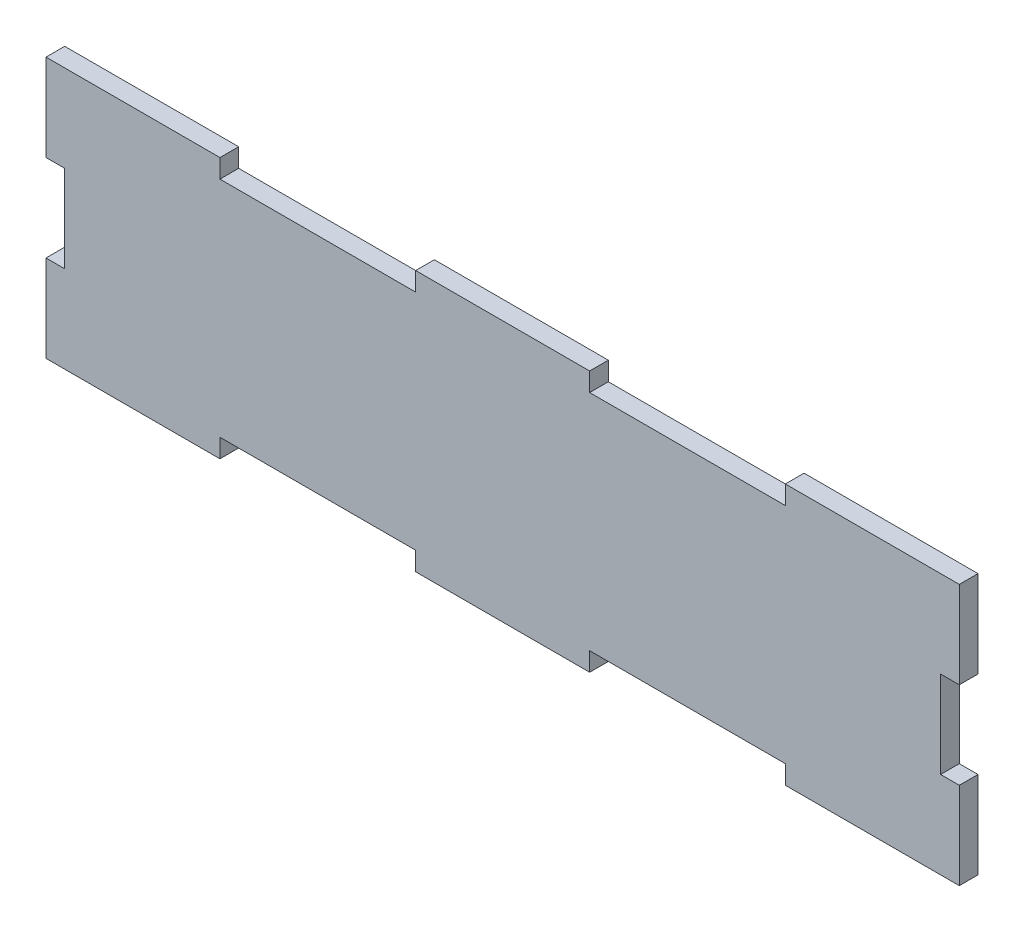
ISO-10303-21;
HEADER;
FILE_DESCRIPTION(('STEP AP214'),'2;1');
FILE_NAME('part.step','',(''),(''),'','','');
FILE_SCHEMA(('AUTOMOTIVE_DESIGN { 1 0 10303 214 1 1 1 1 }'));
ENDSEC;
DATA;
#1=APPLICATION_CONTEXT('core data for automotive mechanical design processes');
#2=APPLICATION_PROTOCOL_DEFINITION('international standard','automotive_design',2000,#1);
#3=PRODUCT_CONTEXT('',#1,'mechanical');
#4=PRODUCT('Part','Part','',(#3));
#5=PRODUCT_RELATED_PRODUCT_CATEGORY('part','',(#4));
#6=PRODUCT_DEFINITION_FORMATION('','',#4);
#7=PRODUCT_DEFINITION_CONTEXT('part definition',#1,'design');
#8=PRODUCT_DEFINITION('design','',#6,#7);
#9=PRODUCT_DEFINITION_SHAPE('','',#8);
#10=(LENGTH_UNIT() NAMED_UNIT(*) SI_UNIT(.MILLI.,.METRE.));
#11=(NAMED_UNIT(*) PLANE_ANGLE_UNIT() SI_UNIT($,.RADIAN.));
#12=(NAMED_UNIT(*) SI_UNIT($,.STERADIAN.) SOLID_ANGLE_UNIT());
#13=UNCERTAINTY_MEASURE_WITH_UNIT(LENGTH_MEASURE(1.E-05),#10,'distance_accuracy_value','');
#14=(GEOMETRIC_REPRESENTATION_CONTEXT(3) GLOBAL_UNCERTAINTY_ASSIGNED_CONTEXT((#13)) GLOBAL_UNIT_ASSIGNED_CONTEXT((#10,
#11,#12)) REPRESENTATION_CONTEXT('',''));
#15=CARTESIAN_POINT('',(0.,0.,0.));
#16=DIRECTION('',(0.,0.,1.));
#17=DIRECTION('',(1.,0.,0.));
#18=AXIS2_PLACEMENT_3D('',#15,#16,#17);
#19=CARTESIAN_POINT('',(0.,0.,2.7305));
#20=DIRECTION('',(0.,0.,1.));
#21=DIRECTION('',(1.,0.,0.));
#22=AXIS2_PLACEMENT_3D('',#19,#20,#21);
#23=PLANE('',#22);
#24=DIRECTION('',(0.,1.,0.));
#25=VECTOR('',#24,1.);
#26=CARTESIAN_POINT('',(133.35,38.1,2.7305));
#27=LINE('',#26,#25);
#28=CARTESIAN_POINT('',(133.35,-38.1,2.7305));
#29=VERTEX_POINT('',#28);
#30=CARTESIAN_POINT('',(133.35,-12.7,2.7305));
#31=VERTEX_POINT('',#30);
#32=EDGE_CURVE('E342',#29,#31,#27,.T.);
#33=ORIENTED_EDGE('',*,*,#32,.T.);
#34=DIRECTION('',(-1.,0.,0.));
#35=VECTOR('',#34,1.);
#36=CARTESIAN_POINT('',(133.35,-12.7,2.7305));
#37=LINE('',#36,#35);
#38=CARTESIAN_POINT('',(127.889,-12.7,2.7305));
#39=VERTEX_POINT('',#38);
#40=EDGE_CURVE('E228',#31,#39,#37,.T.);
#41=ORIENTED_EDGE('',*,*,#40,.T.);
#42=DIRECTION('',(0.,1.,0.));
#43=VECTOR('',#42,1.);
#44=CARTESIAN_POINT('',(127.889,12.7,2.7305));
#45=LINE('',#44,#43);
#46=CARTESIAN_POINT('',(127.889,12.7,2.7305));
#47=VERTEX_POINT('',#46);
#48=EDGE_CURVE('E400',#39,#47,#45,.T.);
#49=ORIENTED_EDGE('',*,*,#48,.T.);
#50=DIRECTION('',(1.,0.,0.));
#51=VECTOR('',#50,1.);
#52=CARTESIAN_POINT('',(133.35,12.7,2.7305));
#53=LINE('',#52,#51);
#54=CARTESIAN_POINT('',(133.35,12.7,2.7305));
#55=VERTEX_POINT('',#54);
#56=EDGE_CURVE('E398',#47,#55,#53,.T.);
#57=ORIENTED_EDGE('',*,*,#56,.T.);
#58=CARTESIAN_POINT('',(133.35,38.1,2.7305));
#59=VERTEX_POINT('',#58);
#60=EDGE_CURVE('E236',#55,#59,#27,.T.);
#61=ORIENTED_EDGE('',*,*,#60,.T.);
#62=DIRECTION('',(-1.,0.,0.));
#63=VECTOR('',#62,1.);
#64=CARTESIAN_POINT('',(-133.35,38.1,2.7305));
#65=LINE('',#64,#63);
#66=CARTESIAN_POINT('',(82.55,38.1,2.73050000000014));
#67=VERTEX_POINT('',#66);
#68=EDGE_CURVE('E346',#59,#67,#65,.T.);
#69=ORIENTED_EDGE('',*,*,#68,.T.);
#70=DIRECTION('',(0.,-1.,0.));
#71=VECTOR('',#70,1.);
#72=CARTESIAN_POINT('',(82.55,38.1,2.73050000000014));
#73=LINE('',#72,#71);
#74=CARTESIAN_POINT('',(82.55,32.639,2.73050000000013));
#75=VERTEX_POINT('',#74);
#76=EDGE_CURVE('E459',#67,#75,#73,.T.);
#77=ORIENTED_EDGE('',*,*,#76,.T.);
#78=DIRECTION('',(1.,0.,0.));
#79=VECTOR('',#78,1.);
#80=CARTESIAN_POINT('',(0.,32.639,2.73050000000013));
#81=LINE('',#80,#79);
#82=CARTESIAN_POINT('',(25.4,32.639,2.73050000000013));
#83=VERTEX_POINT('',#82);
#84=EDGE_CURVE('E454',#83,#75,#81,.T.);
#85=ORIENTED_EDGE('',*,*,#84,.F.);
#86=DIRECTION('',(0.,-1.,0.));
#87=VECTOR('',#86,1.);
#88=CARTESIAN_POINT('',(25.4,38.1,2.73050000000014));
#89=LINE('',#88,#87);
#90=CARTESIAN_POINT('',(25.4,38.1,2.73050000000014));
#91=VERTEX_POINT('',#90);
#92=EDGE_CURVE('E462',#91,#83,#89,.T.);
#93=ORIENTED_EDGE('',*,*,#92,.F.);
#94=CARTESIAN_POINT('',(-25.4,38.1,2.73050000000014));
#95=VERTEX_POINT('',#94);
#96=EDGE_CURVE('E349',#91,#95,#65,.T.);
#97=ORIENTED_EDGE('',*,*,#96,.T.);
#98=DIRECTION('',(0.,-1.,0.));
#99=VECTOR('',#98,1.);
#100=CARTESIAN_POINT('',(-25.4,38.1,2.73050000000014));
#101=LINE('',#100,#99);
#102=CARTESIAN_POINT('',(-25.4,32.639,2.73050000000013));
#103=VERTEX_POINT('',#102);
#104=EDGE_CURVE('E469',#95,#103,#101,.T.);
#105=ORIENTED_EDGE('',*,*,#104,.T.);
#106=DIRECTION('',(-1.,0.,0.));
#107=VECTOR('',#106,1.);
#108=CARTESIAN_POINT('',(0.,32.639,2.73050000000013));
#109=LINE('',#108,#107);
#110=CARTESIAN_POINT('',(-82.55,32.639,2.73050000000013));
#111=VERTEX_POINT('',#110);
#112=EDGE_CURVE('E445',#103,#111,#109,.T.);
#113=ORIENTED_EDGE('',*,*,#112,.T.);
#114=DIRECTION('',(0.,-1.,0.));
#115=VECTOR('',#114,1.);
#116=CARTESIAN_POINT('',(-82.55,38.1,2.73050000000014));
#117=LINE('',#116,#115);
#118=CARTESIAN_POINT('',(-82.55,38.1,2.73050000000014));
#119=VERTEX_POINT('',#118);
#120=EDGE_CURVE('E251',#119,#111,#117,.T.);
#121=ORIENTED_EDGE('',*,*,#120,.F.);
#122=CARTESIAN_POINT('',(-133.35,38.1,2.7305));
#123=VERTEX_POINT('',#122);
#124=EDGE_CURVE('E345',#119,#123,#65,.T.);
#125=ORIENTED_EDGE('',*,*,#124,.T.);
#126=DIRECTION('',(0.,-1.,0.));
#127=VECTOR('',#126,1.);
#128=CARTESIAN_POINT('',(-133.35,38.1,2.7305));
#129=LINE('',#128,#127);
#130=CARTESIAN_POINT('',(-133.35,12.7,2.7305));
#131=VERTEX_POINT('',#130);
#132=EDGE_CURVE('E350',#123,#131,#129,.T.);
#133=ORIENTED_EDGE('',*,*,#132,.T.);
#134=DIRECTION('',(-1.,0.,0.));
#135=VECTOR('',#134,1.);
#136=CARTESIAN_POINT('',(-133.35,12.7,2.7305));
#137=LINE('',#136,#135);
#138=CARTESIAN_POINT('',(-127.889,12.7,2.7305));
#139=VERTEX_POINT('',#138);
#140=EDGE_CURVE('E413',#139,#131,#137,.T.);
#141=ORIENTED_EDGE('',*,*,#140,.F.);
#142=DIRECTION('',(0.,1.,0.));
#143=VECTOR('',#142,1.);
#144=CARTESIAN_POINT('',(-127.889,12.7,2.7305));
#145=LINE('',#144,#143);
#146=CARTESIAN_POINT('',(-127.889,-12.7,2.7305));
#147=VERTEX_POINT('',#146);
#148=EDGE_CURVE('E420',#147,#139,#145,.T.);
#149=ORIENTED_EDGE('',*,*,#148,.F.);
#150=DIRECTION('',(1.,0.,0.));
#151=VECTOR('',#150,1.);
#152=CARTESIAN_POINT('',(-133.35,-12.7,2.7305));
#153=LINE('',#152,#151);
#154=CARTESIAN_POINT('',(-133.35,-12.7,2.7305));
#155=VERTEX_POINT('',#154);
#156=EDGE_CURVE('E365',#155,#147,#153,.T.);
#157=ORIENTED_EDGE('',*,*,#156,.F.);
#158=CARTESIAN_POINT('',(-133.35,-38.1,2.7305));
#159=VERTEX_POINT('',#158);
#160=EDGE_CURVE('E348',#155,#159,#129,.T.);
#161=ORIENTED_EDGE('',*,*,#160,.T.);
#162=DIRECTION('',(1.,0.,0.));
#163=VECTOR('',#162,1.);
#164=CARTESIAN_POINT('',(-133.35,-38.1,2.7305));
#165=LINE('',#164,#163);
#166=CARTESIAN_POINT('',(-82.55,-38.1,2.73050000000015));
#167=VERTEX_POINT('',#166);
#168=EDGE_CURVE('E255',#159,#167,#165,.T.);
#169=ORIENTED_EDGE('',*,*,#168,.T.);
#170=DIRECTION('',(0.,-1.,0.));
#171=VECTOR('',#170,1.);
#172=CARTESIAN_POINT('',(-82.55,-32.639,2.73050000000013));
#173=LINE('',#172,#171);
#174=CARTESIAN_POINT('',(-82.55,-32.639,2.73050000000013));
#175=VERTEX_POINT('',#174);
#176=EDGE_CURVE('E338',#175,#167,#173,.T.);
#177=ORIENTED_EDGE('',*,*,#176,.F.);
#178=DIRECTION('',(-1.,0.,0.));
#179=VECTOR('',#178,1.);
#180=CARTESIAN_POINT('',(0.,-32.639,2.73050000000013));
#181=LINE('',#180,#179);
#182=CARTESIAN_POINT('',(-25.4,-32.639,2.73050000000013));
#183=VERTEX_POINT('',#182);
#184=EDGE_CURVE('E305',#183,#175,#181,.T.);
#185=ORIENTED_EDGE('',*,*,#184,.F.);
#186=DIRECTION('',(0.,-1.,0.));
#187=VECTOR('',#186,1.);
#188=CARTESIAN_POINT('',(-25.4,-32.639,2.73050000000013));
#189=LINE('',#188,#187);
#190=CARTESIAN_POINT('',(-25.4,-38.1,2.73050000000015));
#191=VERTEX_POINT('',#190);
#192=EDGE_CURVE('E303',#183,#191,#189,.T.);
#193=ORIENTED_EDGE('',*,*,#192,.T.);
#194=CARTESIAN_POINT('',(25.4,-38.1,2.73050000000015));
#195=VERTEX_POINT('',#194);
#196=EDGE_CURVE('E356',#191,#195,#165,.T.);
#197=ORIENTED_EDGE('',*,*,#196,.T.);
#198=DIRECTION('',(0.,-1.,0.));
#199=VECTOR('',#198,1.);
#200=CARTESIAN_POINT('',(25.4,-32.639,2.73050000000013));
#201=LINE('',#200,#199);
#202=CARTESIAN_POINT('',(25.4,-32.639,2.73050000000013));
#203=VERTEX_POINT('',#202);
#204=EDGE_CURVE('E332',#203,#195,#201,.T.);
#205=ORIENTED_EDGE('',*,*,#204,.F.);
#206=DIRECTION('',(1.,0.,0.));
#207=VECTOR('',#206,1.);
#208=CARTESIAN_POINT('',(0.,-32.639,2.73050000000013));
#209=LINE('',#208,#207);
#210=CARTESIAN_POINT('',(82.55,-32.639,2.73050000000013));
#211=VERTEX_POINT('',#210);
#212=EDGE_CURVE('E307',#203,#211,#209,.T.);
#213=ORIENTED_EDGE('',*,*,#212,.T.);
#214=DIRECTION('',(0.,-1.,0.));
#215=VECTOR('',#214,1.);
#216=CARTESIAN_POINT('',(82.55,-32.639,2.73050000000013));
#217=LINE('',#216,#215);
#218=CARTESIAN_POINT('',(82.55,-38.1,2.73050000000015));
#219=VERTEX_POINT('',#218);
#220=EDGE_CURVE('E329',#211,#219,#217,.T.);
#221=ORIENTED_EDGE('',*,*,#220,.T.);
#222=EDGE_CURVE('E352',#219,#29,#165,.T.);
#223=ORIENTED_EDGE('',*,*,#222,.T.);
#224=EDGE_LOOP('',(#33,#41,#49,#57,#61,#69,#77,#85,#93,#97,#105,#113,#121,#125,#133,#141,#149,
#157,#161,#169,#177,#185,#193,#197,#205,#213,#221,#223));
#225=FACE_BOUND('',#224,.T.);
#226=ADVANCED_FACE('F37',(#225),#23,.T.);
#227=CARTESIAN_POINT('',(133.35,38.1,2.7305));
#228=DIRECTION('',(-1.,0.,0.));
#229=DIRECTION('',(0.,0.,1.));
#230=AXIS2_PLACEMENT_3D('',#227,#228,#229);
#231=PLANE('',#230);
#232=DIRECTION('',(0.,0.,1.));
#233=VECTOR('',#232,1.);
#234=CARTESIAN_POINT('',(133.35,-12.7,-2.7305));
#235=LINE('',#234,#233);
#236=CARTESIAN_POINT('',(133.35,-12.7,-2.7305));
#237=VERTEX_POINT('',#236);
#238=EDGE_CURVE('E405',#237,#31,#235,.T.);
#239=ORIENTED_EDGE('',*,*,#238,.T.);
#240=ORIENTED_EDGE('',*,*,#32,.F.);
#241=DIRECTION('',(0.,0.,-1.));
#242=VECTOR('',#241,1.);
#243=CARTESIAN_POINT('',(133.35,-38.1,2.7305));
#244=LINE('',#243,#242);
#245=CARTESIAN_POINT('',(133.35,-38.1,-2.7305));
#246=VERTEX_POINT('',#245);
#247=EDGE_CURVE('E268',#29,#246,#244,.T.);
#248=ORIENTED_EDGE('',*,*,#247,.T.);
#249=DIRECTION('',(0.,1.,0.));
#250=VECTOR('',#249,1.);
#251=CARTESIAN_POINT('',(133.35,38.1,-2.7305));
#252=LINE('',#251,#250);
#253=EDGE_CURVE('E245',#246,#237,#252,.T.);
#254=ORIENTED_EDGE('',*,*,#253,.T.);
#255=EDGE_LOOP('',(#239,#240,#248,#254));
#256=FACE_BOUND('',#255,.T.);
#257=ADVANCED_FACE('F39',(#256),#231,.F.);
#258=DIRECTION('',(0.,0.,1.));
#259=VECTOR('',#258,1.);
#260=CARTESIAN_POINT('',(133.35,12.7,-2.7305));
#261=LINE('',#260,#259);
#262=CARTESIAN_POINT('',(133.35,12.7,-2.7305));
#263=VERTEX_POINT('',#262);
#264=EDGE_CURVE('E222',#263,#55,#261,.T.);
#265=ORIENTED_EDGE('',*,*,#264,.F.);
#266=CARTESIAN_POINT('',(133.35,38.1,-2.7305));
#267=VERTEX_POINT('',#266);
#268=EDGE_CURVE('E234',#263,#267,#252,.T.);
#269=ORIENTED_EDGE('',*,*,#268,.T.);
#270=DIRECTION('',(0.,0.,-1.));
#271=VECTOR('',#270,1.);
#272=CARTESIAN_POINT('',(133.35,38.1,2.7305));
#273=LINE('',#272,#271);
#274=EDGE_CURVE('E277',#59,#267,#273,.T.);
#275=ORIENTED_EDGE('',*,*,#274,.F.);
#276=ORIENTED_EDGE('',*,*,#60,.F.);
#277=EDGE_LOOP('',(#265,#269,#275,#276));
#278=FACE_BOUND('',#277,.T.);
#279=ADVANCED_FACE('F232',(#278),#231,.F.);
#280=CARTESIAN_POINT('',(0.,0.,-2.7305));
#281=DIRECTION('',(0.,0.,1.));
#282=DIRECTION('',(1.,0.,0.));
#283=AXIS2_PLACEMENT_3D('',#280,#281,#282);
#284=PLANE('',#283);
#285=DIRECTION('',(-1.,0.,0.));
#286=VECTOR('',#285,1.);
#287=CARTESIAN_POINT('',(133.35,-12.7,-2.7305));
#288=LINE('',#287,#286);
#289=CARTESIAN_POINT('',(127.889,-12.7,-2.7305));
#290=VERTEX_POINT('',#289);
#291=EDGE_CURVE('E237',#237,#290,#288,.T.);
#292=ORIENTED_EDGE('',*,*,#291,.F.);
#293=ORIENTED_EDGE('',*,*,#253,.F.);
#294=DIRECTION('',(1.,0.,0.));
#295=VECTOR('',#294,1.);
#296=CARTESIAN_POINT('',(-133.35,-38.1,-2.7305));
#297=LINE('',#296,#295);
#298=CARTESIAN_POINT('',(82.55,-38.1,-2.73049999999984));
#299=VERTEX_POINT('',#298);
#300=EDGE_CURVE('E263',#299,#246,#297,.T.);
#301=ORIENTED_EDGE('',*,*,#300,.F.);
#302=DIRECTION('',(0.,-1.,0.));
#303=VECTOR('',#302,1.);
#304=CARTESIAN_POINT('',(82.55,-32.639,-2.73049999999986));
#305=LINE('',#304,#303);
#306=CARTESIAN_POINT('',(82.55,-32.639,-2.73049999999986));
#307=VERTEX_POINT('',#306);
#308=EDGE_CURVE('E317',#307,#299,#305,.T.);
#309=ORIENTED_EDGE('',*,*,#308,.F.);
#310=DIRECTION('',(-1.,0.,0.));
#311=VECTOR('',#310,1.);
#312=CARTESIAN_POINT('',(0.,-32.639,-2.7305));
#313=LINE('',#312,#311);
#314=CARTESIAN_POINT('',(25.4,-32.639,-2.7305));
#315=VERTEX_POINT('',#314);
#316=EDGE_CURVE('E279',#307,#315,#313,.T.);
#317=ORIENTED_EDGE('',*,*,#316,.T.);
#318=DIRECTION('',(0.,-1.,0.));
#319=VECTOR('',#318,1.);
#320=CARTESIAN_POINT('',(25.4,-32.639,-2.73049999999981));
#321=LINE('',#320,#319);
#322=CARTESIAN_POINT('',(25.4,-38.1,-2.73049999999979));
#323=VERTEX_POINT('',#322);
#324=EDGE_CURVE('E334',#315,#323,#321,.T.);
#325=ORIENTED_EDGE('',*,*,#324,.T.);
#326=CARTESIAN_POINT('',(-25.4,-38.1,-2.73049999999979));
#327=VERTEX_POINT('',#326);
#328=EDGE_CURVE('E267',#327,#323,#297,.T.);
#329=ORIENTED_EDGE('',*,*,#328,.F.);
#330=DIRECTION('',(0.,-1.,0.));
#331=VECTOR('',#330,1.);
#332=CARTESIAN_POINT('',(-25.4,-32.639,-2.73049999999981));
#333=LINE('',#332,#331);
#334=CARTESIAN_POINT('',(-25.4,-32.639,-2.73049999999981));
#335=VERTEX_POINT('',#334);
#336=EDGE_CURVE('E290',#335,#327,#333,.T.);
#337=ORIENTED_EDGE('',*,*,#336,.F.);
#338=CARTESIAN_POINT('',(-82.55,-32.639,-2.7305));
#339=VERTEX_POINT('',#338);
#340=EDGE_CURVE('E278',#335,#339,#313,.T.);
#341=ORIENTED_EDGE('',*,*,#340,.T.);
#342=DIRECTION('',(0.,-1.,0.));
#343=VECTOR('',#342,1.);
#344=CARTESIAN_POINT('',(-82.55,-32.639,-2.73049999999986));
#345=LINE('',#344,#343);
#346=CARTESIAN_POINT('',(-82.55,-38.1,-2.73049999999984));
#347=VERTEX_POINT('',#346);
#348=EDGE_CURVE('E288',#339,#347,#345,.T.);
#349=ORIENTED_EDGE('',*,*,#348,.T.);
#350=CARTESIAN_POINT('',(-133.35,-38.1,-2.7305));
#351=VERTEX_POINT('',#350);
#352=EDGE_CURVE('E264',#351,#347,#297,.T.);
#353=ORIENTED_EDGE('',*,*,#352,.F.);
#354=DIRECTION('',(0.,-1.,0.));
#355=VECTOR('',#354,1.);
#356=CARTESIAN_POINT('',(-133.35,38.1,-2.7305));
#357=LINE('',#356,#355);
#358=CARTESIAN_POINT('',(-133.35,-12.7,-2.7305));
#359=VERTEX_POINT('',#358);
#360=EDGE_CURVE('E258',#359,#351,#357,.T.);
#361=ORIENTED_EDGE('',*,*,#360,.F.);
#362=DIRECTION('',(1.,0.,0.));
#363=VECTOR('',#362,1.);
#364=CARTESIAN_POINT('',(-133.35,-12.7,-2.7305));
#365=LINE('',#364,#363);
#366=CARTESIAN_POINT('',(-127.889,-12.7,-2.7305));
#367=VERTEX_POINT('',#366);
#368=EDGE_CURVE('E410',#359,#367,#365,.T.);
#369=ORIENTED_EDGE('',*,*,#368,.T.);
#370=DIRECTION('',(0.,1.,0.));
#371=VECTOR('',#370,1.);
#372=CARTESIAN_POINT('',(-127.889,12.7,-2.7305));
#373=LINE('',#372,#371);
#374=CARTESIAN_POINT('',(-127.889,12.7,-2.7305));
#375=VERTEX_POINT('',#374);
#376=EDGE_CURVE('E60',#367,#375,#373,.T.);
#377=ORIENTED_EDGE('',*,*,#376,.T.);
#378=DIRECTION('',(-1.,0.,0.));
#379=VECTOR('',#378,1.);
#380=CARTESIAN_POINT('',(-133.35,12.7,-2.7305));
#381=LINE('',#380,#379);
#382=CARTESIAN_POINT('',(-133.35,12.7,-2.7305));
#383=VERTEX_POINT('',#382);
#384=EDGE_CURVE('E415',#375,#383,#381,.T.);
#385=ORIENTED_EDGE('',*,*,#384,.T.);
#386=CARTESIAN_POINT('',(-133.35,38.1,-2.7305));
#387=VERTEX_POINT('',#386);
#388=EDGE_CURVE('E260',#387,#383,#357,.T.);
#389=ORIENTED_EDGE('',*,*,#388,.F.);
#390=DIRECTION('',(-1.,0.,0.));
#391=VECTOR('',#390,1.);
#392=CARTESIAN_POINT('',(-133.35,38.1,-2.7305));
#393=LINE('',#392,#391);
#394=CARTESIAN_POINT('',(-82.55,38.1,-2.73049999999984));
#395=VERTEX_POINT('',#394);
#396=EDGE_CURVE('E249',#395,#387,#393,.T.);
#397=ORIENTED_EDGE('',*,*,#396,.F.);
#398=DIRECTION('',(0.,-1.,0.));
#399=VECTOR('',#398,1.);
#400=CARTESIAN_POINT('',(-82.55,38.1,-2.73049999999984));
#401=LINE('',#400,#399);
#402=CARTESIAN_POINT('',(-82.55,32.639,-2.73049999999986));
#403=VERTEX_POINT('',#402);
#404=EDGE_CURVE('E246',#395,#403,#401,.T.);
#405=ORIENTED_EDGE('',*,*,#404,.T.);
#406=DIRECTION('',(-1.,0.,0.));
#407=VECTOR('',#406,1.);
#408=CARTESIAN_POINT('',(0.,32.639,-2.7305));
#409=LINE('',#408,#407);
#410=CARTESIAN_POINT('',(-25.4,32.639,-2.7305));
#411=VERTEX_POINT('',#410);
#412=EDGE_CURVE('E45',#411,#403,#409,.T.);
#413=ORIENTED_EDGE('',*,*,#412,.F.);
#414=DIRECTION('',(0.,-1.,0.));
#415=VECTOR('',#414,1.);
#416=CARTESIAN_POINT('',(-25.4,38.1,-2.73049999999979));
#417=LINE('',#416,#415);
#418=CARTESIAN_POINT('',(-25.4,38.1,-2.73049999999979));
#419=VERTEX_POINT('',#418);
#420=EDGE_CURVE('E467',#419,#411,#417,.T.);
#421=ORIENTED_EDGE('',*,*,#420,.F.);
#422=CARTESIAN_POINT('',(25.4,38.1,-2.73049999999979));
#423=VERTEX_POINT('',#422);
#424=EDGE_CURVE('E259',#423,#419,#393,.T.);
#425=ORIENTED_EDGE('',*,*,#424,.F.);
#426=DIRECTION('',(0.,-1.,0.));
#427=VECTOR('',#426,1.);
#428=CARTESIAN_POINT('',(25.4,38.1,-2.73049999999979));
#429=LINE('',#428,#427);
#430=CARTESIAN_POINT('',(25.4,32.639,-2.73049999999981));
#431=VERTEX_POINT('',#430);
#432=EDGE_CURVE('E464',#423,#431,#429,.T.);
#433=ORIENTED_EDGE('',*,*,#432,.T.);
#434=CARTESIAN_POINT('',(82.55,32.639,-2.7305));
#435=VERTEX_POINT('',#434);
#436=EDGE_CURVE('E11',#435,#431,#409,.T.);
#437=ORIENTED_EDGE('',*,*,#436,.F.);
#438=DIRECTION('',(0.,-1.,0.));
#439=VECTOR('',#438,1.);
#440=CARTESIAN_POINT('',(82.55,38.1,-2.73049999999984));
#441=LINE('',#440,#439);
#442=CARTESIAN_POINT('',(82.55,38.1,-2.73049999999984));
#443=VERTEX_POINT('',#442);
#444=EDGE_CURVE('E442',#443,#435,#441,.T.);
#445=ORIENTED_EDGE('',*,*,#444,.F.);
#446=EDGE_CURVE('E243',#267,#443,#393,.T.);
#447=ORIENTED_EDGE('',*,*,#446,.F.);
#448=ORIENTED_EDGE('',*,*,#268,.F.);
#449=DIRECTION('',(1.,0.,0.));
#450=VECTOR('',#449,1.);
#451=CARTESIAN_POINT('',(133.35,12.7,-2.7305));
#452=LINE('',#451,#450);
#453=CARTESIAN_POINT('',(127.889,12.7,-2.7305));
#454=VERTEX_POINT('',#453);
#455=EDGE_CURVE('E219',#454,#263,#452,.T.);
#456=ORIENTED_EDGE('',*,*,#455,.F.);
#457=DIRECTION('',(0.,1.,0.));
#458=VECTOR('',#457,1.);
#459=CARTESIAN_POINT('',(127.889,12.7,-2.7305));
#460=LINE('',#459,#458);
#461=EDGE_CURVE('E227',#290,#454,#460,.T.);
#462=ORIENTED_EDGE('',*,*,#461,.F.);
#463=EDGE_LOOP('',(#292,#293,#301,#309,#317,#325,#329,#337,#341,#349,#353,#361,#369,#377,#385,
#389,#397,#405,#413,#421,#425,#433,#437,#445,#447,#448,#456,#462));
#464=FACE_BOUND('',#463,.T.);
#465=ADVANCED_FACE('F240',(#464),#284,.F.);
#466=CARTESIAN_POINT('',(-133.35,38.1,2.7305));
#467=DIRECTION('',(1.,0.,0.));
#468=DIRECTION('',(0.,1.,0.));
#469=AXIS2_PLACEMENT_3D('',#466,#467,#468);
#470=PLANE('',#469);
#471=ORIENTED_EDGE('',*,*,#388,.T.);
#472=DIRECTION('',(0.,0.,1.));
#473=VECTOR('',#472,1.);
#474=CARTESIAN_POINT('',(-133.35,12.7,-2.7305));
#475=LINE('',#474,#473);
#476=EDGE_CURVE('E321',#383,#131,#475,.T.);
#477=ORIENTED_EDGE('',*,*,#476,.T.);
#478=ORIENTED_EDGE('',*,*,#132,.F.);
#479=DIRECTION('',(0.,0.,-1.));
#480=VECTOR('',#479,1.);
#481=CARTESIAN_POINT('',(-133.35,38.1,2.7305));
#482=LINE('',#481,#480);
#483=EDGE_CURVE('E274',#123,#387,#482,.T.);
#484=ORIENTED_EDGE('',*,*,#483,.T.);
#485=EDGE_LOOP('',(#471,#477,#478,#484));
#486=FACE_BOUND('',#485,.T.);
#487=ADVANCED_FACE('F498',(#486),#470,.F.);
#488=CARTESIAN_POINT('',(-133.35,38.1,2.7305));
#489=DIRECTION('',(0.,-1.,0.));
#490=DIRECTION('',(0.,0.,-1.));
#491=AXIS2_PLACEMENT_3D('',#488,#489,#490);
#492=PLANE('',#491);
#493=DIRECTION('',(0.,0.,-1.));
#494=VECTOR('',#493,1.);
#495=CARTESIAN_POINT('',(-25.4,38.1,-6.79449999999986));
#496=LINE('',#495,#494);
#497=EDGE_CURVE('E434',#95,#419,#496,.T.);
#498=ORIENTED_EDGE('',*,*,#497,.F.);
#499=ORIENTED_EDGE('',*,*,#96,.F.);
#500=DIRECTION('',(0.,0.,-1.));
#501=VECTOR('',#500,1.);
#502=CARTESIAN_POINT('',(25.4,38.1,-6.79449999999986));
#503=LINE('',#502,#501);
#504=EDGE_CURVE('E437',#91,#423,#503,.T.);
#505=ORIENTED_EDGE('',*,*,#504,.T.);
#506=ORIENTED_EDGE('',*,*,#424,.T.);
#507=EDGE_LOOP('',(#498,#499,#505,#506));
#508=FACE_BOUND('',#507,.T.);
#509=ADVANCED_FACE('F490',(#508),#492,.F.);
#510=DIRECTION('',(0.,0.,-1.));
#511=VECTOR('',#510,1.);
#512=CARTESIAN_POINT('',(82.55,38.1,-6.79449999999986));
#513=LINE('',#512,#511);
#514=EDGE_CURVE('E440',#67,#443,#513,.T.);
#515=ORIENTED_EDGE('',*,*,#514,.F.);
#516=ORIENTED_EDGE('',*,*,#68,.F.);
#517=ORIENTED_EDGE('',*,*,#274,.T.);
#518=ORIENTED_EDGE('',*,*,#446,.T.);
#519=EDGE_LOOP('',(#515,#516,#517,#518));
#520=FACE_BOUND('',#519,.T.);
#521=ADVANCED_FACE('F531',(#520),#492,.F.);
#522=CARTESIAN_POINT('',(-133.35,-38.1,2.7305));
#523=DIRECTION('',(0.,1.,0.));
#524=DIRECTION('',(0.,0.,1.));
#525=AXIS2_PLACEMENT_3D('',#522,#523,#524);
#526=PLANE('',#525);
#527=DIRECTION('',(0.,0.,-1.));
#528=VECTOR('',#527,1.);
#529=CARTESIAN_POINT('',(25.4,-38.1,-6.79449999999985));
#530=LINE('',#529,#528);
#531=EDGE_CURVE('E323',#195,#323,#530,.T.);
#532=ORIENTED_EDGE('',*,*,#531,.F.);
#533=ORIENTED_EDGE('',*,*,#196,.F.);
#534=DIRECTION('',(0.,0.,-1.));
#535=VECTOR('',#534,1.);
#536=CARTESIAN_POINT('',(-25.4,-38.1,-6.79449999999985));
#537=LINE('',#536,#535);
#538=EDGE_CURVE('E320',#191,#327,#537,.T.);
#539=ORIENTED_EDGE('',*,*,#538,.T.);
#540=ORIENTED_EDGE('',*,*,#328,.T.);
#541=EDGE_LOOP('',(#532,#533,#539,#540));
#542=FACE_BOUND('',#541,.T.);
#543=ADVANCED_FACE('F378',(#542),#526,.F.);
#544=DIRECTION('',(0.,0.,-1.));
#545=VECTOR('',#544,1.);
#546=CARTESIAN_POINT('',(-82.55,-38.1,-6.79449999999985));
#547=LINE('',#546,#545);
#548=EDGE_CURVE('E318',#167,#347,#547,.T.);
#549=ORIENTED_EDGE('',*,*,#548,.F.);
#550=ORIENTED_EDGE('',*,*,#168,.F.);
#551=DIRECTION('',(0.,0.,-1.));
#552=VECTOR('',#551,1.);
#553=CARTESIAN_POINT('',(-133.35,-38.1,2.7305));
#554=LINE('',#553,#552);
#555=EDGE_CURVE('E271',#159,#351,#554,.T.);
#556=ORIENTED_EDGE('',*,*,#555,.T.);
#557=ORIENTED_EDGE('',*,*,#352,.T.);
#558=EDGE_LOOP('',(#549,#550,#556,#557));
#559=FACE_BOUND('',#558,.T.);
#560=ADVANCED_FACE('F372',(#559),#526,.F.);
#561=ORIENTED_EDGE('',*,*,#124,.F.);
#562=DIRECTION('',(0.,0.,-1.));
#563=VECTOR('',#562,1.);
#564=CARTESIAN_POINT('',(-82.55,38.1,-6.79449999999986));
#565=LINE('',#564,#563);
#566=EDGE_CURVE('E431',#119,#395,#565,.T.);
#567=ORIENTED_EDGE('',*,*,#566,.T.);
#568=ORIENTED_EDGE('',*,*,#396,.T.);
#569=ORIENTED_EDGE('',*,*,#483,.F.);
#570=EDGE_LOOP('',(#561,#567,#568,#569));
#571=FACE_BOUND('',#570,.T.);
#572=ADVANCED_FACE('F495',(#571),#492,.F.);
#573=ORIENTED_EDGE('',*,*,#160,.F.);
#574=DIRECTION('',(0.,0.,1.));
#575=VECTOR('',#574,1.);
#576=CARTESIAN_POINT('',(-133.35,-12.7,-2.7305));
#577=LINE('',#576,#575);
#578=EDGE_CURVE('E418',#359,#155,#577,.T.);
#579=ORIENTED_EDGE('',*,*,#578,.F.);
#580=ORIENTED_EDGE('',*,*,#360,.T.);
#581=ORIENTED_EDGE('',*,*,#555,.F.);
#582=EDGE_LOOP('',(#573,#579,#580,#581));
#583=FACE_BOUND('',#582,.T.);
#584=ADVANCED_FACE('F368',(#583),#470,.F.);
#585=ORIENTED_EDGE('',*,*,#222,.F.);
#586=DIRECTION('',(0.,0.,-1.));
#587=VECTOR('',#586,1.);
#588=CARTESIAN_POINT('',(82.55,-38.1,-6.79449999999985));
#589=LINE('',#588,#587);
#590=EDGE_CURVE('E325',#219,#299,#589,.T.);
#591=ORIENTED_EDGE('',*,*,#590,.T.);
#592=ORIENTED_EDGE('',*,*,#300,.T.);
#593=ORIENTED_EDGE('',*,*,#247,.F.);
#594=EDGE_LOOP('',(#585,#591,#592,#593));
#595=FACE_BOUND('',#594,.T.);
#596=ADVANCED_FACE('F388',(#595),#526,.F.);
#597=CARTESIAN_POINT('',(0.,-32.639,-6.79449999999987));
#598=DIRECTION('',(0.,1.,0.));
#599=DIRECTION('',(1.,0.,0.));
#600=AXIS2_PLACEMENT_3D('',#597,#598,#599);
#601=PLANE('',#600);
#602=DIRECTION('',(0.,0.,-1.));
#603=VECTOR('',#602,1.);
#604=CARTESIAN_POINT('',(-25.4,-32.639,-6.79449999999987));
#605=LINE('',#604,#603);
#606=EDGE_CURVE('E296',#183,#335,#605,.T.);
#607=ORIENTED_EDGE('',*,*,#606,.F.);
#608=ORIENTED_EDGE('',*,*,#184,.T.);
#609=DIRECTION('',(0.,0.,-1.));
#610=VECTOR('',#609,1.);
#611=CARTESIAN_POINT('',(-82.55,-32.639,-6.79449999999987));
#612=LINE('',#611,#610);
#613=EDGE_CURVE('E298',#175,#339,#612,.T.);
#614=ORIENTED_EDGE('',*,*,#613,.T.);
#615=ORIENTED_EDGE('',*,*,#340,.F.);
#616=EDGE_LOOP('',(#607,#608,#614,#615));
#617=FACE_BOUND('',#616,.T.);
#618=ADVANCED_FACE('F294',(#617),#601,.F.);
#619=CARTESIAN_POINT('',(-25.4,-32.639,-6.79449999999987));
#620=DIRECTION('',(-1.,0.,0.));
#621=DIRECTION('',(0.,1.,0.));
#622=AXIS2_PLACEMENT_3D('',#619,#620,#621);
#623=PLANE('',#622);
#624=ORIENTED_EDGE('',*,*,#538,.F.);
#625=ORIENTED_EDGE('',*,*,#192,.F.);
#626=ORIENTED_EDGE('',*,*,#606,.T.);
#627=ORIENTED_EDGE('',*,*,#336,.T.);
#628=EDGE_LOOP('',(#624,#625,#626,#627));
#629=FACE_BOUND('',#628,.T.);
#630=ADVANCED_FACE('F300',(#629),#623,.T.);
#631=CARTESIAN_POINT('',(-82.55,-32.639,-6.79449999999987));
#632=DIRECTION('',(-1.,0.,0.));
#633=DIRECTION('',(0.,1.,0.));
#634=AXIS2_PLACEMENT_3D('',#631,#632,#633);
#635=PLANE('',#634);
#636=ORIENTED_EDGE('',*,*,#548,.T.);
#637=ORIENTED_EDGE('',*,*,#348,.F.);
#638=ORIENTED_EDGE('',*,*,#613,.F.);
#639=ORIENTED_EDGE('',*,*,#176,.T.);
#640=EDGE_LOOP('',(#636,#637,#638,#639));
#641=FACE_BOUND('',#640,.T.);
#642=ADVANCED_FACE('F523',(#641),#635,.F.);
#643=DIRECTION('',(0.,0.,-1.));
#644=VECTOR('',#643,1.);
#645=CARTESIAN_POINT('',(82.55,-32.639,-6.79449999999987));
#646=LINE('',#645,#644);
#647=EDGE_CURVE('E314',#211,#307,#646,.T.);
#648=ORIENTED_EDGE('',*,*,#647,.F.);
#649=ORIENTED_EDGE('',*,*,#212,.F.);
#650=DIRECTION('',(0.,0.,-1.));
#651=VECTOR('',#650,1.);
#652=CARTESIAN_POINT('',(25.4,-32.639,-6.79449999999987));
#653=LINE('',#652,#651);
#654=EDGE_CURVE('E304',#203,#315,#653,.T.);
#655=ORIENTED_EDGE('',*,*,#654,.T.);
#656=ORIENTED_EDGE('',*,*,#316,.F.);
#657=EDGE_LOOP('',(#648,#649,#655,#656));
#658=FACE_BOUND('',#657,.T.);
#659=ADVANCED_FACE('F551',(#658),#601,.F.);
#660=CARTESIAN_POINT('',(25.4,-32.639,-6.79449999999987));
#661=DIRECTION('',(-1.,0.,0.));
#662=DIRECTION('',(0.,1.,0.));
#663=AXIS2_PLACEMENT_3D('',#660,#661,#662);
#664=PLANE('',#663);
#665=ORIENTED_EDGE('',*,*,#531,.T.);
#666=ORIENTED_EDGE('',*,*,#324,.F.);
#667=ORIENTED_EDGE('',*,*,#654,.F.);
#668=ORIENTED_EDGE('',*,*,#204,.T.);
#669=EDGE_LOOP('',(#665,#666,#667,#668));
#670=FACE_BOUND('',#669,.T.);
#671=ADVANCED_FACE('F382',(#670),#664,.F.);
#672=CARTESIAN_POINT('',(82.55,-32.639,-6.79449999999987));
#673=DIRECTION('',(-1.,0.,0.));
#674=DIRECTION('',(0.,1.,0.));
#675=AXIS2_PLACEMENT_3D('',#672,#673,#674);
#676=PLANE('',#675);
#677=ORIENTED_EDGE('',*,*,#590,.F.);
#678=ORIENTED_EDGE('',*,*,#220,.F.);
#679=ORIENTED_EDGE('',*,*,#647,.T.);
#680=ORIENTED_EDGE('',*,*,#308,.T.);
#681=EDGE_LOOP('',(#677,#678,#679,#680));
#682=FACE_BOUND('',#681,.T.);
#683=ADVANCED_FACE('F549',(#682),#676,.T.);
#684=CARTESIAN_POINT('',(0.,32.639,-6.79449999999988));
#685=DIRECTION('',(0.,1.,0.));
#686=DIRECTION('',(1.,0.,0.));
#687=AXIS2_PLACEMENT_3D('',#684,#685,#686);
#688=PLANE('',#687);
#689=ORIENTED_EDGE('',*,*,#412,.T.);
#690=DIRECTION('',(0.,0.,-1.));
#691=VECTOR('',#690,1.);
#692=CARTESIAN_POINT('',(-82.55,32.639,-6.79449999999988));
#693=LINE('',#692,#691);
#694=EDGE_CURVE('E341',#111,#403,#693,.T.);
#695=ORIENTED_EDGE('',*,*,#694,.F.);
#696=ORIENTED_EDGE('',*,*,#112,.F.);
#697=DIRECTION('',(0.,0.,-1.));
#698=VECTOR('',#697,1.);
#699=CARTESIAN_POINT('',(-25.4,32.639,-6.79449999999988));
#700=LINE('',#699,#698);
#701=EDGE_CURVE('E448',#103,#411,#700,.T.);
#702=ORIENTED_EDGE('',*,*,#701,.T.);
#703=EDGE_LOOP('',(#689,#695,#696,#702));
#704=FACE_BOUND('',#703,.T.);
#705=ADVANCED_FACE('F479',(#704),#688,.T.);
#706=CARTESIAN_POINT('',(-25.4,38.1,-6.79449999999986));
#707=DIRECTION('',(-1.,0.,0.));
#708=DIRECTION('',(0.,1.,0.));
#709=AXIS2_PLACEMENT_3D('',#706,#707,#708);
#710=PLANE('',#709);
#711=ORIENTED_EDGE('',*,*,#701,.F.);
#712=ORIENTED_EDGE('',*,*,#104,.F.);
#713=ORIENTED_EDGE('',*,*,#497,.T.);
#714=ORIENTED_EDGE('',*,*,#420,.T.);
#715=EDGE_LOOP('',(#711,#712,#713,#714));
#716=FACE_BOUND('',#715,.T.);
#717=ADVANCED_FACE('F486',(#716),#710,.T.);
#718=CARTESIAN_POINT('',(-82.55,38.1,-6.79449999999986));
#719=DIRECTION('',(-1.,0.,0.));
#720=DIRECTION('',(0.,1.,0.));
#721=AXIS2_PLACEMENT_3D('',#718,#719,#720);
#722=PLANE('',#721);
#723=ORIENTED_EDGE('',*,*,#694,.T.);
#724=ORIENTED_EDGE('',*,*,#404,.F.);
#725=ORIENTED_EDGE('',*,*,#566,.F.);
#726=ORIENTED_EDGE('',*,*,#120,.T.);
#727=EDGE_LOOP('',(#723,#724,#725,#726));
#728=FACE_BOUND('',#727,.T.);
#729=ADVANCED_FACE('F475',(#728),#722,.F.);
#730=ORIENTED_EDGE('',*,*,#436,.T.);
#731=DIRECTION('',(0.,0.,-1.));
#732=VECTOR('',#731,1.);
#733=CARTESIAN_POINT('',(25.4,32.639,-6.79449999999988));
#734=LINE('',#733,#732);
#735=EDGE_CURVE('E451',#83,#431,#734,.T.);
#736=ORIENTED_EDGE('',*,*,#735,.F.);
#737=ORIENTED_EDGE('',*,*,#84,.T.);
#738=DIRECTION('',(0.,0.,-1.));
#739=VECTOR('',#738,1.);
#740=CARTESIAN_POINT('',(82.55,32.639,-6.79449999999988));
#741=LINE('',#740,#739);
#742=EDGE_CURVE('E435',#75,#435,#741,.T.);
#743=ORIENTED_EDGE('',*,*,#742,.T.);
#744=EDGE_LOOP('',(#730,#736,#737,#743));
#745=FACE_BOUND('',#744,.T.);
#746=ADVANCED_FACE('F572',(#745),#688,.T.);
#747=CARTESIAN_POINT('',(25.4,38.1,-6.79449999999986));
#748=DIRECTION('',(-1.,0.,0.));
#749=DIRECTION('',(0.,1.,0.));
#750=AXIS2_PLACEMENT_3D('',#747,#748,#749);
#751=PLANE('',#750);
#752=ORIENTED_EDGE('',*,*,#735,.T.);
#753=ORIENTED_EDGE('',*,*,#432,.F.);
#754=ORIENTED_EDGE('',*,*,#504,.F.);
#755=ORIENTED_EDGE('',*,*,#92,.T.);
#756=EDGE_LOOP('',(#752,#753,#754,#755));
#757=FACE_BOUND('',#756,.T.);
#758=ADVANCED_FACE('F579',(#757),#751,.F.);
#759=CARTESIAN_POINT('',(82.55,38.1,-6.79449999999986));
#760=DIRECTION('',(-1.,0.,0.));
#761=DIRECTION('',(0.,1.,0.));
#762=AXIS2_PLACEMENT_3D('',#759,#760,#761);
#763=PLANE('',#762);
#764=ORIENTED_EDGE('',*,*,#742,.F.);
#765=ORIENTED_EDGE('',*,*,#76,.F.);
#766=ORIENTED_EDGE('',*,*,#514,.T.);
#767=ORIENTED_EDGE('',*,*,#444,.T.);
#768=EDGE_LOOP('',(#764,#765,#766,#767));
#769=FACE_BOUND('',#768,.T.);
#770=ADVANCED_FACE('F585',(#769),#763,.T.);
#771=CARTESIAN_POINT('',(-133.35,12.7,-2.7305));
#772=DIRECTION('',(0.,1.,0.));
#773=DIRECTION('',(0.,0.,1.));
#774=AXIS2_PLACEMENT_3D('',#771,#772,#773);
#775=PLANE('',#774);
#776=ORIENTED_EDGE('',*,*,#140,.T.);
#777=ORIENTED_EDGE('',*,*,#476,.F.);
#778=ORIENTED_EDGE('',*,*,#384,.F.);
#779=DIRECTION('',(0.,0.,1.));
#780=VECTOR('',#779,1.);
#781=CARTESIAN_POINT('',(-127.889,12.7,-2.7305));
#782=LINE('',#781,#780);
#783=EDGE_CURVE('E426',#375,#139,#782,.T.);
#784=ORIENTED_EDGE('',*,*,#783,.T.);
#785=EDGE_LOOP('',(#776,#777,#778,#784));
#786=FACE_BOUND('',#785,.T.);
#787=ADVANCED_FACE('F501',(#786),#775,.F.);
#788=CARTESIAN_POINT('',(-127.889,12.7,-2.7305));
#789=DIRECTION('',(1.,0.,0.));
#790=DIRECTION('',(0.,0.,-1.));
#791=AXIS2_PLACEMENT_3D('',#788,#789,#790);
#792=PLANE('',#791);
#793=ORIENTED_EDGE('',*,*,#148,.T.);
#794=ORIENTED_EDGE('',*,*,#783,.F.);
#795=ORIENTED_EDGE('',*,*,#376,.F.);
#796=DIRECTION('',(0.,0.,1.));
#797=VECTOR('',#796,1.);
#798=CARTESIAN_POINT('',(-127.889,-12.7,-2.7305));
#799=LINE('',#798,#797);
#800=EDGE_CURVE('E428',#367,#147,#799,.T.);
#801=ORIENTED_EDGE('',*,*,#800,.T.);
#802=EDGE_LOOP('',(#793,#794,#795,#801));
#803=FACE_BOUND('',#802,.T.);
#804=ADVANCED_FACE('F502',(#803),#792,.F.);
#805=CARTESIAN_POINT('',(-133.35,-12.7,-2.7305));
#806=DIRECTION('',(0.,-1.,0.));
#807=DIRECTION('',(0.,0.,-1.));
#808=AXIS2_PLACEMENT_3D('',#805,#806,#807);
#809=PLANE('',#808);
#810=ORIENTED_EDGE('',*,*,#156,.T.);
#811=ORIENTED_EDGE('',*,*,#800,.F.);
#812=ORIENTED_EDGE('',*,*,#368,.F.);
#813=ORIENTED_EDGE('',*,*,#578,.T.);
#814=EDGE_LOOP('',(#810,#811,#812,#813));
#815=FACE_BOUND('',#814,.T.);
#816=ADVANCED_FACE('F504',(#815),#809,.F.);
#817=CARTESIAN_POINT('',(133.35,-12.7,-2.7305));
#818=DIRECTION('',(0.,1.,0.));
#819=DIRECTION('',(0.,0.,1.));
#820=AXIS2_PLACEMENT_3D('',#817,#818,#819);
#821=PLANE('',#820);
#822=ORIENTED_EDGE('',*,*,#40,.F.);
#823=ORIENTED_EDGE('',*,*,#238,.F.);
#824=ORIENTED_EDGE('',*,*,#291,.T.);
#825=DIRECTION('',(0.,0.,1.));
#826=VECTOR('',#825,1.);
#827=CARTESIAN_POINT('',(127.889,-12.7,-2.7305));
#828=LINE('',#827,#826);
#829=EDGE_CURVE('E407',#290,#39,#828,.T.);
#830=ORIENTED_EDGE('',*,*,#829,.T.);
#831=EDGE_LOOP('',(#822,#823,#824,#830));
#832=FACE_BOUND('',#831,.T.);
#833=ADVANCED_FACE('F506',(#832),#821,.T.);
#834=CARTESIAN_POINT('',(127.889,12.7,-2.7305));
#835=DIRECTION('',(1.,0.,0.));
#836=DIRECTION('',(0.,0.,-1.));
#837=AXIS2_PLACEMENT_3D('',#834,#835,#836);
#838=PLANE('',#837);
#839=ORIENTED_EDGE('',*,*,#48,.F.);
#840=ORIENTED_EDGE('',*,*,#829,.F.);
#841=ORIENTED_EDGE('',*,*,#461,.T.);
#842=DIRECTION('',(0.,0.,1.));
#843=VECTOR('',#842,1.);
#844=CARTESIAN_POINT('',(127.889,12.7,-2.7305));
#845=LINE('',#844,#843);
#846=EDGE_CURVE('E52',#454,#47,#845,.T.);
#847=ORIENTED_EDGE('',*,*,#846,.T.);
#848=EDGE_LOOP('',(#839,#840,#841,#847));
#849=FACE_BOUND('',#848,.T.);
#850=ADVANCED_FACE('F512',(#849),#838,.T.);
#851=CARTESIAN_POINT('',(133.35,12.7,-2.7305));
#852=DIRECTION('',(0.,-1.,0.));
#853=DIRECTION('',(0.,0.,-1.));
#854=AXIS2_PLACEMENT_3D('',#851,#852,#853);
#855=PLANE('',#854);
#856=ORIENTED_EDGE('',*,*,#56,.F.);
#857=ORIENTED_EDGE('',*,*,#846,.F.);
#858=ORIENTED_EDGE('',*,*,#455,.T.);
#859=ORIENTED_EDGE('',*,*,#264,.T.);
#860=EDGE_LOOP('',(#856,#857,#858,#859));
#861=FACE_BOUND('',#860,.T.);
#862=ADVANCED_FACE('F221',(#861),#855,.T.);
#863=CLOSED_SHELL('',(#226,#257,#279,#465,#487,#509,#521,#543,#560,#572,#584,#596,#618,#630,
#642,#659,#671,#683,#705,#717,#729,#746,#758,#770,#787,#804,#816,#833,#850,#862));
#864=MANIFOLD_SOLID_BREP('B2',#863);
#865=ADVANCED_BREP_SHAPE_REPRESENTATION('',(#18,#864),#14);
#866=SHAPE_DEFINITION_REPRESENTATION(#9,#865);
ENDSEC;
END-ISO-10303-21;
